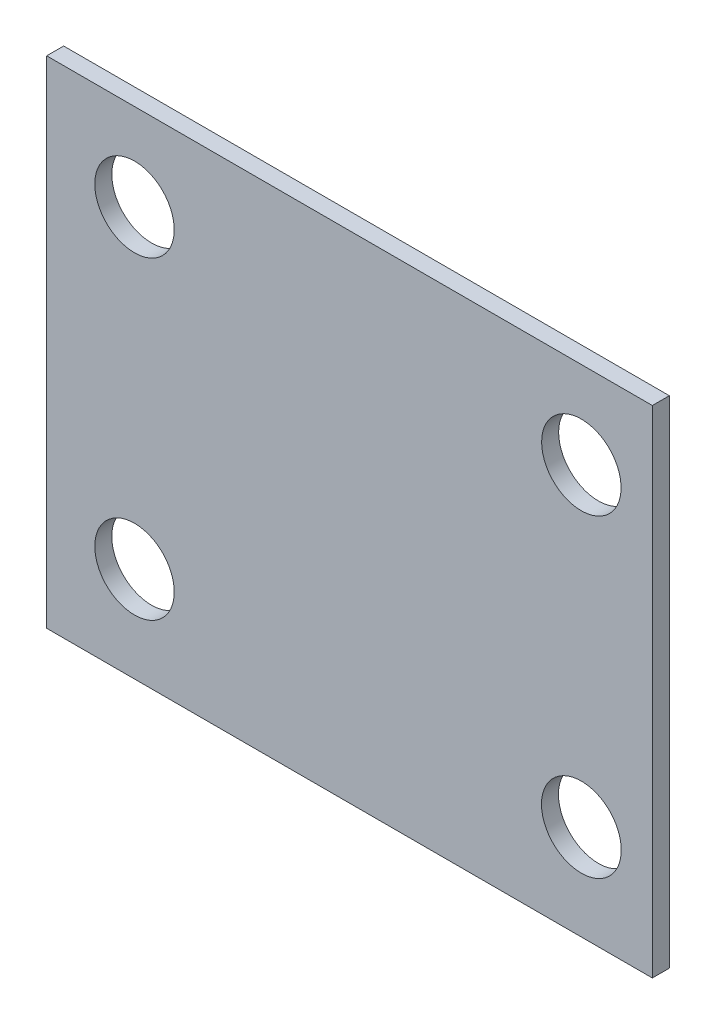
ISO-10303-21;
HEADER;
FILE_DESCRIPTION(('STEP AP214'),'2;1');
FILE_NAME('part.step','',(''),(''),'','','');
FILE_SCHEMA(('AUTOMOTIVE_DESIGN { 1 0 10303 214 1 1 1 1 }'));
ENDSEC;
DATA;
#1=APPLICATION_CONTEXT('core data for automotive mechanical design processes');
#2=APPLICATION_PROTOCOL_DEFINITION('international standard','automotive_design',2000,#1);
#3=PRODUCT_CONTEXT('',#1,'mechanical');
#4=PRODUCT('Part','Part','',(#3));
#5=PRODUCT_RELATED_PRODUCT_CATEGORY('part','',(#4));
#6=PRODUCT_DEFINITION_FORMATION('','',#4);
#7=PRODUCT_DEFINITION_CONTEXT('part definition',#1,'design');
#8=PRODUCT_DEFINITION('design','',#6,#7);
#9=PRODUCT_DEFINITION_SHAPE('','',#8);
#10=(LENGTH_UNIT() NAMED_UNIT(*) SI_UNIT(.MILLI.,.METRE.));
#11=(NAMED_UNIT(*) PLANE_ANGLE_UNIT() SI_UNIT($,.RADIAN.));
#12=(NAMED_UNIT(*) SI_UNIT($,.STERADIAN.) SOLID_ANGLE_UNIT());
#13=UNCERTAINTY_MEASURE_WITH_UNIT(LENGTH_MEASURE(1.E-05),#10,'distance_accuracy_value','');
#14=(GEOMETRIC_REPRESENTATION_CONTEXT(3) GLOBAL_UNCERTAINTY_ASSIGNED_CONTEXT((#13)) GLOBAL_UNIT_ASSIGNED_CONTEXT((#10,
#11,#12)) REPRESENTATION_CONTEXT('',''));
#15=CARTESIAN_POINT('',(0.,0.,0.));
#16=DIRECTION('',(0.,0.,1.));
#17=DIRECTION('',(1.,0.,0.));
#18=AXIS2_PLACEMENT_3D('',#15,#16,#17);
#19=CARTESIAN_POINT('',(0.,0.,1.69));
#20=DIRECTION('',(1.,0.,0.));
#21=DIRECTION('',(0.,1.,0.));
#22=AXIS2_PLACEMENT_3D('',#19,#20,#21);
#23=PLANE('',#22);
#24=DIRECTION('',(0.,-1.,0.));
#25=VECTOR('',#24,1.);
#26=CARTESIAN_POINT('',(0.,0.,0.));
#27=LINE('',#26,#25);
#28=CARTESIAN_POINT('',(0.,49.32,0.));
#29=VERTEX_POINT('',#28);
#30=CARTESIAN_POINT('',(0.,0.,0.));
#31=VERTEX_POINT('',#30);
#32=EDGE_CURVE('E106',#29,#31,#27,.T.);
#33=ORIENTED_EDGE('',*,*,#32,.T.);
#34=DIRECTION('',(0.,0.,-1.));
#35=VECTOR('',#34,1.);
#36=CARTESIAN_POINT('',(0.,0.,1.69));
#37=LINE('',#36,#35);
#38=CARTESIAN_POINT('',(0.,0.,1.69));
#39=VERTEX_POINT('',#38);
#40=EDGE_CURVE('E11',#39,#31,#37,.T.);
#41=ORIENTED_EDGE('',*,*,#40,.F.);
#42=DIRECTION('',(0.,-1.,0.));
#43=VECTOR('',#42,1.);
#44=CARTESIAN_POINT('',(0.,0.,1.69));
#45=LINE('',#44,#43);
#46=CARTESIAN_POINT('',(0.,49.32,1.69));
#47=VERTEX_POINT('',#46);
#48=EDGE_CURVE('E90',#47,#39,#45,.T.);
#49=ORIENTED_EDGE('',*,*,#48,.F.);
#50=DIRECTION('',(0.,0.,-1.));
#51=VECTOR('',#50,1.);
#52=CARTESIAN_POINT('',(0.,49.32,1.69));
#53=LINE('',#52,#51);
#54=EDGE_CURVE('E102',#47,#29,#53,.T.);
#55=ORIENTED_EDGE('',*,*,#54,.T.);
#56=EDGE_LOOP('',(#33,#41,#49,#55));
#57=FACE_BOUND('',#56,.T.);
#58=ADVANCED_FACE('F38',(#57),#23,.F.);
#59=CARTESIAN_POINT('',(0.,0.,1.69));
#60=DIRECTION('',(0.,1.,0.));
#61=DIRECTION('',(0.,0.,1.));
#62=AXIS2_PLACEMENT_3D('',#59,#60,#61);
#63=PLANE('',#62);
#64=DIRECTION('',(1.,0.,0.));
#65=VECTOR('',#64,1.);
#66=CARTESIAN_POINT('',(0.,0.,0.));
#67=LINE('',#66,#65);
#68=CARTESIAN_POINT('',(60.25,0.,0.));
#69=VERTEX_POINT('',#68);
#70=EDGE_CURVE('E95',#31,#69,#67,.T.);
#71=ORIENTED_EDGE('',*,*,#70,.T.);
#72=DIRECTION('',(0.,0.,-1.));
#73=VECTOR('',#72,1.);
#74=CARTESIAN_POINT('',(60.25,0.,1.69));
#75=LINE('',#74,#73);
#76=CARTESIAN_POINT('',(60.25,0.,1.69));
#77=VERTEX_POINT('',#76);
#78=EDGE_CURVE('E47',#77,#69,#75,.T.);
#79=ORIENTED_EDGE('',*,*,#78,.F.);
#80=DIRECTION('',(1.,0.,0.));
#81=VECTOR('',#80,1.);
#82=CARTESIAN_POINT('',(0.,0.,1.69));
#83=LINE('',#82,#81);
#84=EDGE_CURVE('E85',#39,#77,#83,.T.);
#85=ORIENTED_EDGE('',*,*,#84,.F.);
#86=ORIENTED_EDGE('',*,*,#40,.T.);
#87=EDGE_LOOP('',(#71,#79,#85,#86));
#88=FACE_BOUND('',#87,.T.);
#89=ADVANCED_FACE('F94',(#88),#63,.F.);
#90=CARTESIAN_POINT('',(60.25,0.,1.69));
#91=DIRECTION('',(-1.,0.,0.));
#92=DIRECTION('',(0.,-1.,0.));
#93=AXIS2_PLACEMENT_3D('',#90,#91,#92);
#94=PLANE('',#93);
#95=DIRECTION('',(0.,1.,0.));
#96=VECTOR('',#95,1.);
#97=CARTESIAN_POINT('',(60.25,0.,0.));
#98=LINE('',#97,#96);
#99=CARTESIAN_POINT('',(60.25,49.32,0.));
#100=VERTEX_POINT('',#99);
#101=EDGE_CURVE('E72',#69,#100,#98,.T.);
#102=ORIENTED_EDGE('',*,*,#101,.T.);
#103=DIRECTION('',(0.,0.,-1.));
#104=VECTOR('',#103,1.);
#105=CARTESIAN_POINT('',(60.25,49.32,1.69));
#106=LINE('',#105,#104);
#107=CARTESIAN_POINT('',(60.25,49.32,1.69));
#108=VERTEX_POINT('',#107);
#109=EDGE_CURVE('E97',#108,#100,#106,.T.);
#110=ORIENTED_EDGE('',*,*,#109,.F.);
#111=DIRECTION('',(0.,1.,0.));
#112=VECTOR('',#111,1.);
#113=CARTESIAN_POINT('',(60.25,0.,1.69));
#114=LINE('',#113,#112);
#115=EDGE_CURVE('E88',#77,#108,#114,.T.);
#116=ORIENTED_EDGE('',*,*,#115,.F.);
#117=ORIENTED_EDGE('',*,*,#78,.T.);
#118=EDGE_LOOP('',(#102,#110,#116,#117));
#119=FACE_BOUND('',#118,.T.);
#120=ADVANCED_FACE('F98',(#119),#94,.F.);
#121=CARTESIAN_POINT('',(0.,49.32,1.69));
#122=DIRECTION('',(0.,-1.,0.));
#123=DIRECTION('',(0.,0.,-1.));
#124=AXIS2_PLACEMENT_3D('',#121,#122,#123);
#125=PLANE('',#124);
#126=DIRECTION('',(-1.,0.,0.));
#127=VECTOR('',#126,1.);
#128=CARTESIAN_POINT('',(0.,49.32,0.));
#129=LINE('',#128,#127);
#130=EDGE_CURVE('E78',#100,#29,#129,.T.);
#131=ORIENTED_EDGE('',*,*,#130,.T.);
#132=ORIENTED_EDGE('',*,*,#54,.F.);
#133=DIRECTION('',(-1.,0.,0.));
#134=VECTOR('',#133,1.);
#135=CARTESIAN_POINT('',(0.,49.32,1.69));
#136=LINE('',#135,#134);
#137=EDGE_CURVE('E55',#108,#47,#136,.T.);
#138=ORIENTED_EDGE('',*,*,#137,.F.);
#139=ORIENTED_EDGE('',*,*,#109,.T.);
#140=EDGE_LOOP('',(#131,#132,#138,#139));
#141=FACE_BOUND('',#140,.T.);
#142=ADVANCED_FACE('F120',(#141),#125,.F.);
#143=CARTESIAN_POINT('',(0.,0.,1.69));
#144=DIRECTION('',(0.,0.,-1.));
#145=DIRECTION('',(-1.,0.,0.));
#146=AXIS2_PLACEMENT_3D('',#143,#144,#145);
#147=PLANE('',#146);
#148=CARTESIAN_POINT('',(8.73889677780731,9.46653354737215,1.69));
#149=DIRECTION('',(0.,0.,-1.));
#150=DIRECTION('',(-1.,0.,0.));
#151=AXIS2_PLACEMENT_3D('',#148,#149,#150);
#152=CIRCLE('',#151,3.95215283869724);
#153=CARTESIAN_POINT('',(4.78674393911007,9.46653354737215,1.69));
#154=VERTEX_POINT('',#153);
#155=EDGE_CURVE('E139',#154,#154,#152,.T.);
#156=ORIENTED_EDGE('',*,*,#155,.T.);
#157=EDGE_LOOP('',(#156));
#158=FACE_BOUND('',#157,.T.);
#159=CARTESIAN_POINT('',(53.1888916554427,9.46651929080097,1.69));
#160=DIRECTION('',(0.,0.,-1.));
#161=DIRECTION('',(-1.,0.,0.));
#162=AXIS2_PLACEMENT_3D('',#159,#160,#161);
#163=CIRCLE('',#162,3.9687490463257);
#164=CARTESIAN_POINT('',(49.220142609117,9.46651929080097,1.69));
#165=VERTEX_POINT('',#164);
#166=EDGE_CURVE('E147',#165,#165,#163,.T.);
#167=ORIENTED_EDGE('',*,*,#166,.T.);
#168=EDGE_LOOP('',(#167));
#169=FACE_BOUND('',#168,.T.);
#170=CARTESIAN_POINT('',(53.1889017241663,40.6704301470184,1.69));
#171=DIRECTION('',(0.,0.,-1.));
#172=DIRECTION('',(-1.,0.,0.));
#173=AXIS2_PLACEMENT_3D('',#170,#171,#172);
#174=CIRCLE('',#173,3.95215002882804);
#175=CARTESIAN_POINT('',(49.2367516953382,40.6704301470184,1.69));
#176=VERTEX_POINT('',#175);
#177=EDGE_CURVE('E131',#176,#176,#174,.T.);
#178=ORIENTED_EDGE('',*,*,#177,.T.);
#179=EDGE_LOOP('',(#178));
#180=FACE_BOUND('',#179,.T.);
#181=CARTESIAN_POINT('',(8.73889395341571,40.6704301470184,1.69));
#182=DIRECTION('',(0.,0.,-1.));
#183=DIRECTION('',(-1.,0.,0.));
#184=AXIS2_PLACEMENT_3D('',#181,#182,#183);
#185=CIRCLE('',#184,3.95214765461352);
#186=CARTESIAN_POINT('',(4.7867462988022,40.6704301470184,1.69));
#187=VERTEX_POINT('',#186);
#188=EDGE_CURVE('E110',#187,#187,#185,.T.);
#189=ORIENTED_EDGE('',*,*,#188,.T.);
#190=EDGE_LOOP('',(#189));
#191=FACE_BOUND('',#190,.T.);
#192=ORIENTED_EDGE('',*,*,#48,.T.);
#193=ORIENTED_EDGE('',*,*,#84,.T.);
#194=ORIENTED_EDGE('',*,*,#115,.T.);
#195=ORIENTED_EDGE('',*,*,#137,.T.);
#196=EDGE_LOOP('',(#192,#193,#194,#195));
#197=FACE_BOUND('',#196,.T.);
#198=ADVANCED_FACE('F86',(#158,#169,#180,#191,#197),#147,.F.);
#199=CARTESIAN_POINT('',(0.,0.,0.));
#200=DIRECTION('',(0.,0.,-1.));
#201=DIRECTION('',(-1.,0.,0.));
#202=AXIS2_PLACEMENT_3D('',#199,#200,#201);
#203=PLANE('',#202);
#204=CARTESIAN_POINT('',(8.73889677780731,9.46653354737215,0.));
#205=DIRECTION('',(0.,0.,-1.));
#206=DIRECTION('',(-1.,0.,0.));
#207=AXIS2_PLACEMENT_3D('',#204,#205,#206);
#208=CIRCLE('',#207,3.95215283869724);
#209=CARTESIAN_POINT('',(4.78674393911007,9.46653354737215,0.));
#210=VERTEX_POINT('',#209);
#211=EDGE_CURVE('E135',#210,#210,#208,.T.);
#212=ORIENTED_EDGE('',*,*,#211,.F.);
#213=EDGE_LOOP('',(#212));
#214=FACE_BOUND('',#213,.T.);
#215=CARTESIAN_POINT('',(53.1888916554427,9.46651929080097,0.));
#216=DIRECTION('',(0.,0.,-1.));
#217=DIRECTION('',(-1.,0.,0.));
#218=AXIS2_PLACEMENT_3D('',#215,#216,#217);
#219=CIRCLE('',#218,3.9687490463257);
#220=CARTESIAN_POINT('',(49.220142609117,9.46651929080097,0.));
#221=VERTEX_POINT('',#220);
#222=EDGE_CURVE('E143',#221,#221,#219,.T.);
#223=ORIENTED_EDGE('',*,*,#222,.F.);
#224=EDGE_LOOP('',(#223));
#225=FACE_BOUND('',#224,.T.);
#226=CARTESIAN_POINT('',(53.1889017241663,40.6704301470184,0.));
#227=DIRECTION('',(0.,0.,-1.));
#228=DIRECTION('',(-1.,0.,0.));
#229=AXIS2_PLACEMENT_3D('',#226,#227,#228);
#230=CIRCLE('',#229,3.95215002882804);
#231=CARTESIAN_POINT('',(49.2367516953382,40.6704301470184,0.));
#232=VERTEX_POINT('',#231);
#233=EDGE_CURVE('E151',#232,#232,#230,.T.);
#234=ORIENTED_EDGE('',*,*,#233,.F.);
#235=EDGE_LOOP('',(#234));
#236=FACE_BOUND('',#235,.T.);
#237=CARTESIAN_POINT('',(8.73889395341571,40.6704301470184,0.));
#238=DIRECTION('',(0.,0.,-1.));
#239=DIRECTION('',(-1.,0.,0.));
#240=AXIS2_PLACEMENT_3D('',#237,#238,#239);
#241=CIRCLE('',#240,3.95214765461352);
#242=CARTESIAN_POINT('',(4.7867462988022,40.6704301470184,0.));
#243=VERTEX_POINT('',#242);
#244=EDGE_CURVE('E127',#243,#243,#241,.T.);
#245=ORIENTED_EDGE('',*,*,#244,.F.);
#246=EDGE_LOOP('',(#245));
#247=FACE_BOUND('',#246,.T.);
#248=ORIENTED_EDGE('',*,*,#32,.F.);
#249=ORIENTED_EDGE('',*,*,#130,.F.);
#250=ORIENTED_EDGE('',*,*,#101,.F.);
#251=ORIENTED_EDGE('',*,*,#70,.F.);
#252=EDGE_LOOP('',(#248,#249,#250,#251));
#253=FACE_BOUND('',#252,.T.);
#254=ADVANCED_FACE('F123',(#214,#225,#236,#247,#253),#203,.T.);
#255=CARTESIAN_POINT('',(8.73889395341571,40.6704301470184,1.69));
#256=DIRECTION('',(0.,0.,-1.));
#257=DIRECTION('',(-1.,0.,0.));
#258=AXIS2_PLACEMENT_3D('',#255,#256,#257);
#259=CYLINDRICAL_SURFACE('',#258,3.95214765461352);
#260=ORIENTED_EDGE('',*,*,#188,.F.);
#261=EDGE_LOOP('',(#260));
#262=FACE_BOUND('',#261,.T.);
#263=ORIENTED_EDGE('',*,*,#244,.T.);
#264=EDGE_LOOP('',(#263));
#265=FACE_BOUND('',#264,.T.);
#266=ADVANCED_FACE('F165',(#262,#265),#259,.F.);
#267=CARTESIAN_POINT('',(53.1889017241663,40.6704301470184,1.69));
#268=DIRECTION('',(0.,0.,-1.));
#269=DIRECTION('',(-1.,0.,0.));
#270=AXIS2_PLACEMENT_3D('',#267,#268,#269);
#271=CYLINDRICAL_SURFACE('',#270,3.95215002882804);
#272=ORIENTED_EDGE('',*,*,#177,.F.);
#273=EDGE_LOOP('',(#272));
#274=FACE_BOUND('',#273,.T.);
#275=ORIENTED_EDGE('',*,*,#233,.T.);
#276=EDGE_LOOP('',(#275));
#277=FACE_BOUND('',#276,.T.);
#278=ADVANCED_FACE('F161',(#274,#277),#271,.F.);
#279=CARTESIAN_POINT('',(53.1888916554427,9.46651929080097,1.69));
#280=DIRECTION('',(0.,0.,-1.));
#281=DIRECTION('',(-1.,0.,0.));
#282=AXIS2_PLACEMENT_3D('',#279,#280,#281);
#283=CYLINDRICAL_SURFACE('',#282,3.9687490463257);
#284=ORIENTED_EDGE('',*,*,#166,.F.);
#285=EDGE_LOOP('',(#284));
#286=FACE_BOUND('',#285,.T.);
#287=ORIENTED_EDGE('',*,*,#222,.T.);
#288=EDGE_LOOP('',(#287));
#289=FACE_BOUND('',#288,.T.);
#290=ADVANCED_FACE('F164',(#286,#289),#283,.F.);
#291=CARTESIAN_POINT('',(8.73889677780731,9.46653354737215,1.69));
#292=DIRECTION('',(0.,0.,-1.));
#293=DIRECTION('',(-1.,0.,0.));
#294=AXIS2_PLACEMENT_3D('',#291,#292,#293);
#295=CYLINDRICAL_SURFACE('',#294,3.95215283869724);
#296=ORIENTED_EDGE('',*,*,#155,.F.);
#297=EDGE_LOOP('',(#296));
#298=FACE_BOUND('',#297,.T.);
#299=ORIENTED_EDGE('',*,*,#211,.T.);
#300=EDGE_LOOP('',(#299));
#301=FACE_BOUND('',#300,.T.);
#302=ADVANCED_FACE('F203',(#298,#301),#295,.F.);
#303=CLOSED_SHELL('',(#58,#89,#120,#142,#198,#254,#266,#278,#290,#302));
#304=MANIFOLD_SOLID_BREP('B2',#303);
#305=ADVANCED_BREP_SHAPE_REPRESENTATION('',(#18,#304),#14);
#306=SHAPE_DEFINITION_REPRESENTATION(#9,#305);
ENDSEC;
END-ISO-10303-21;
